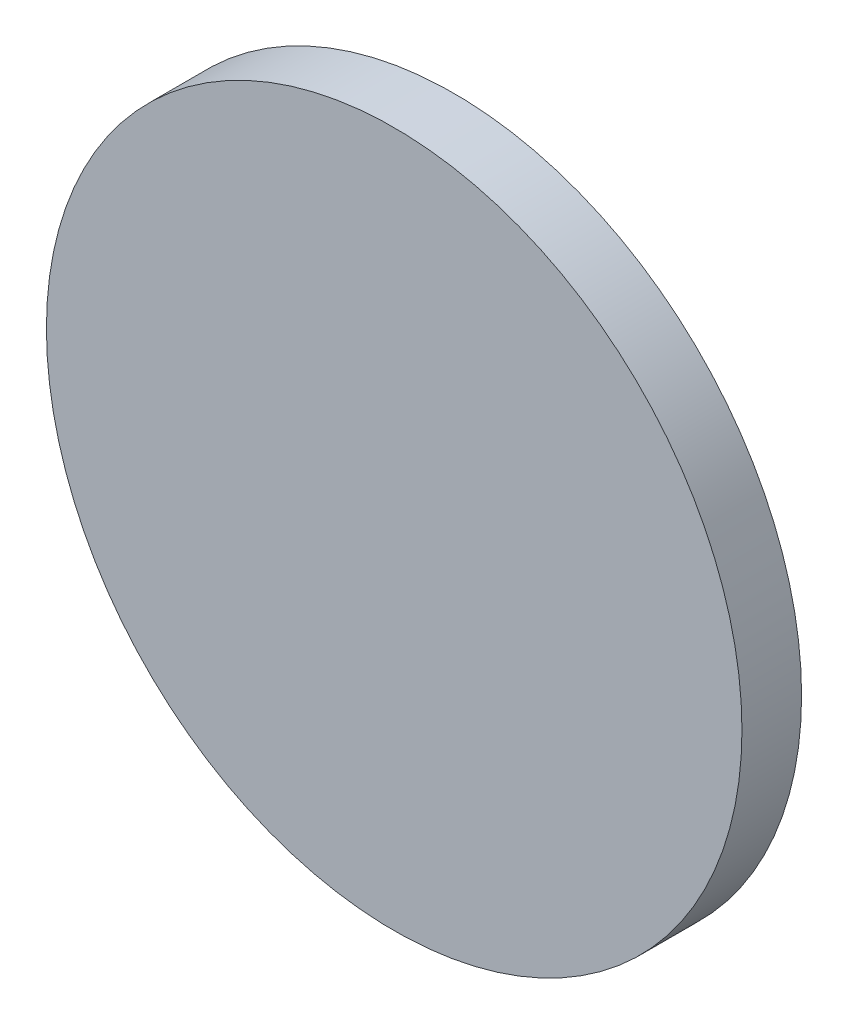
ISO-10303-21;
HEADER;
FILE_DESCRIPTION(('STEP AP214'),'2;1');
FILE_NAME('part.step','',(''),(''),'','','');
FILE_SCHEMA(('AUTOMOTIVE_DESIGN { 1 0 10303 214 1 1 1 1 }'));
ENDSEC;
DATA;
#1=APPLICATION_CONTEXT('core data for automotive mechanical design processes');
#2=APPLICATION_PROTOCOL_DEFINITION('international standard','automotive_design',2000,#1);
#3=PRODUCT_CONTEXT('',#1,'mechanical');
#4=PRODUCT('Part','Part','',(#3));
#5=PRODUCT_RELATED_PRODUCT_CATEGORY('part','',(#4));
#6=PRODUCT_DEFINITION_FORMATION('','',#4);
#7=PRODUCT_DEFINITION_CONTEXT('part definition',#1,'design');
#8=PRODUCT_DEFINITION('design','',#6,#7);
#9=PRODUCT_DEFINITION_SHAPE('','',#8);
#10=(LENGTH_UNIT() NAMED_UNIT(*) SI_UNIT(.MILLI.,.METRE.));
#11=(NAMED_UNIT(*) PLANE_ANGLE_UNIT() SI_UNIT($,.RADIAN.));
#12=(NAMED_UNIT(*) SI_UNIT($,.STERADIAN.) SOLID_ANGLE_UNIT());
#13=UNCERTAINTY_MEASURE_WITH_UNIT(LENGTH_MEASURE(1.E-05),#10,'distance_accuracy_value','');
#14=(GEOMETRIC_REPRESENTATION_CONTEXT(3) GLOBAL_UNCERTAINTY_ASSIGNED_CONTEXT((#13)) GLOBAL_UNIT_ASSIGNED_CONTEXT((#10,
#11,#12)) REPRESENTATION_CONTEXT('',''));
#15=CARTESIAN_POINT('',(0.,0.,0.));
#16=DIRECTION('',(0.,0.,1.));
#17=DIRECTION('',(1.,0.,0.));
#18=AXIS2_PLACEMENT_3D('',#15,#16,#17);
#19=CARTESIAN_POINT('',(1.7399,3.710940006176,0.76487));
#20=DIRECTION('',(0.,0.,-1.));
#21=DIRECTION('',(-1.,0.,0.));
#22=AXIS2_PLACEMENT_3D('',#19,#20,#21);
#23=PLANE('',#22);
#24=CARTESIAN_POINT('',(1.7399,3.710940006176,0.76487));
#25=DIRECTION('',(0.,0.,1.));
#26=DIRECTION('',(1.,0.,0.));
#27=AXIS2_PLACEMENT_3D('',#24,#25,#26);
#28=CIRCLE('',#27,0.200024667);
#29=CARTESIAN_POINT('',(1.939924667,3.710940006176,0.76487));
#30=VERTEX_POINT('',#29);
#31=EDGE_CURVE('E18',#30,#30,#28,.T.);
#32=ORIENTED_EDGE('',*,*,#31,.F.);
#33=EDGE_LOOP('',(#32));
#34=FACE_BOUND('',#33,.T.);
#35=ADVANCED_FACE('F15',(#34),#23,.T.);
#36=CARTESIAN_POINT('',(1.7399,3.710940006176,0.76487));
#37=DIRECTION('',(0.,0.,1.));
#38=DIRECTION('',(1.,0.,0.));
#39=AXIS2_PLACEMENT_3D('',#36,#37,#38);
#40=CYLINDRICAL_SURFACE('',#39,0.200024667);
#41=CARTESIAN_POINT('',(1.7399,3.710940006176,0.79916));
#42=DIRECTION('',(0.,0.,1.));
#43=DIRECTION('',(1.,0.,0.));
#44=AXIS2_PLACEMENT_3D('',#41,#42,#43);
#45=CIRCLE('',#44,0.200024667);
#46=CARTESIAN_POINT('',(1.939924667,3.710940006176,0.79916));
#47=VERTEX_POINT('',#46);
#48=EDGE_CURVE('E10',#47,#47,#45,.T.);
#49=ORIENTED_EDGE('',*,*,#48,.F.);
#50=EDGE_LOOP('',(#49));
#51=FACE_BOUND('',#50,.T.);
#52=ORIENTED_EDGE('',*,*,#31,.T.);
#53=EDGE_LOOP('',(#52));
#54=FACE_BOUND('',#53,.T.);
#55=ADVANCED_FACE('F27',(#51,#54),#40,.T.);
#56=CARTESIAN_POINT('',(1.7399,3.710940006176,0.79916));
#57=DIRECTION('',(0.,0.,1.));
#58=DIRECTION('',(1.,0.,0.));
#59=AXIS2_PLACEMENT_3D('',#56,#57,#58);
#60=PLANE('',#59);
#61=ORIENTED_EDGE('',*,*,#48,.T.);
#62=EDGE_LOOP('',(#61));
#63=FACE_BOUND('',#62,.T.);
#64=ADVANCED_FACE('F34',(#63),#60,.T.);
#65=CLOSED_SHELL('',(#35,#55,#64));
#66=MANIFOLD_SOLID_BREP('B1',#65);
#67=ADVANCED_BREP_SHAPE_REPRESENTATION('',(#18,#66),#14);
#68=SHAPE_DEFINITION_REPRESENTATION(#9,#67);
ENDSEC;
END-ISO-10303-21;
